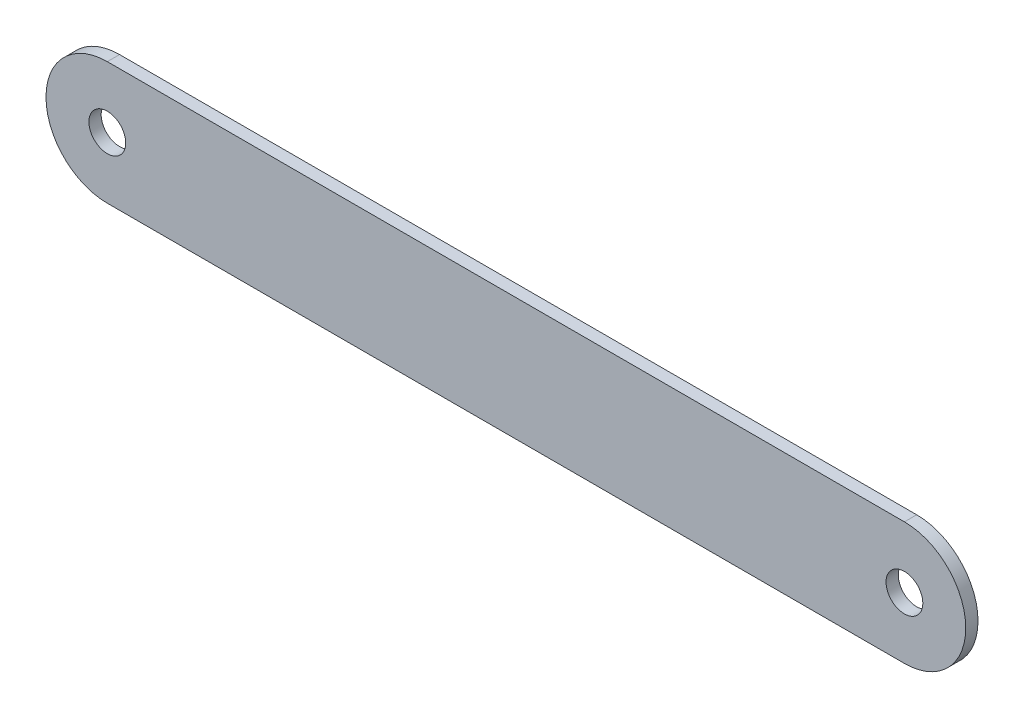
ISO-10303-21;
HEADER;
FILE_DESCRIPTION(('STEP AP214'),'2;1');
FILE_NAME('part.step','',(''),(''),'','','');
FILE_SCHEMA(('AUTOMOTIVE_DESIGN { 1 0 10303 214 1 1 1 1 }'));
ENDSEC;
DATA;
#1=APPLICATION_CONTEXT('core data for automotive mechanical design processes');
#2=APPLICATION_PROTOCOL_DEFINITION('international standard','automotive_design',2000,#1);
#3=PRODUCT_CONTEXT('',#1,'mechanical');
#4=PRODUCT('Part','Part','',(#3));
#5=PRODUCT_RELATED_PRODUCT_CATEGORY('part','',(#4));
#6=PRODUCT_DEFINITION_FORMATION('','',#4);
#7=PRODUCT_DEFINITION_CONTEXT('part definition',#1,'design');
#8=PRODUCT_DEFINITION('design','',#6,#7);
#9=PRODUCT_DEFINITION_SHAPE('','',#8);
#10=(LENGTH_UNIT() NAMED_UNIT(*) SI_UNIT(.MILLI.,.METRE.));
#11=(NAMED_UNIT(*) PLANE_ANGLE_UNIT() SI_UNIT($,.RADIAN.));
#12=(NAMED_UNIT(*) SI_UNIT($,.STERADIAN.) SOLID_ANGLE_UNIT());
#13=UNCERTAINTY_MEASURE_WITH_UNIT(LENGTH_MEASURE(1.E-05),#10,'distance_accuracy_value','');
#14=(GEOMETRIC_REPRESENTATION_CONTEXT(3) GLOBAL_UNCERTAINTY_ASSIGNED_CONTEXT((#13)) GLOBAL_UNIT_ASSIGNED_CONTEXT((#10,
#11,#12)) REPRESENTATION_CONTEXT('',''));
#15=CARTESIAN_POINT('',(0.,0.,0.));
#16=DIRECTION('',(0.,0.,1.));
#17=DIRECTION('',(1.,0.,0.));
#18=AXIS2_PLACEMENT_3D('',#15,#16,#17);
#19=CARTESIAN_POINT('',(-65.,0.,2.));
#20=DIRECTION('',(0.,0.,1.));
#21=DIRECTION('',(1.,0.,0.));
#22=AXIS2_PLACEMENT_3D('',#19,#20,#21);
#23=PLANE('',#22);
#24=CARTESIAN_POINT('',(-65.,0.,2.));
#25=DIRECTION('',(0.,0.,1.));
#26=DIRECTION('',(1.,0.,0.));
#27=AXIS2_PLACEMENT_3D('',#24,#25,#26);
#28=CIRCLE('',#27,3.00000000000001);
#29=CARTESIAN_POINT('',(-62.,0.,2.));
#30=VERTEX_POINT('',#29);
#31=EDGE_CURVE('E102',#30,#30,#28,.T.);
#32=ORIENTED_EDGE('',*,*,#31,.F.);
#33=EDGE_LOOP('',(#32));
#34=FACE_BOUND('',#33,.T.);
#35=CARTESIAN_POINT('',(-65.,0.,2.));
#36=DIRECTION('',(0.,0.,1.));
#37=DIRECTION('',(1.,0.,0.));
#38=AXIS2_PLACEMENT_3D('',#35,#36,#37);
#39=CIRCLE('',#38,9.99999967908888);
#40=CARTESIAN_POINT('',(-65.,9.99999967908888,2.));
#41=VERTEX_POINT('',#40);
#42=CARTESIAN_POINT('',(-65.,-9.99999967908888,2.));
#43=VERTEX_POINT('',#42);
#44=EDGE_CURVE('E87',#41,#43,#39,.T.);
#45=ORIENTED_EDGE('',*,*,#44,.T.);
#46=DIRECTION('',(1.,0.,0.));
#47=VECTOR('',#46,1.);
#48=CARTESIAN_POINT('',(-65.,-9.99999967908888,2.));
#49=LINE('',#48,#47);
#50=CARTESIAN_POINT('',(65.,-9.99999967908888,2.));
#51=VERTEX_POINT('',#50);
#52=EDGE_CURVE('E82',#43,#51,#49,.T.);
#53=ORIENTED_EDGE('',*,*,#52,.T.);
#54=CARTESIAN_POINT('',(65.,0.,2.));
#55=DIRECTION('',(0.,0.,1.));
#56=DIRECTION('',(1.,0.,0.));
#57=AXIS2_PLACEMENT_3D('',#54,#55,#56);
#58=CIRCLE('',#57,9.99999967908888);
#59=CARTESIAN_POINT('',(65.,9.99999967908888,2.));
#60=VERTEX_POINT('',#59);
#61=EDGE_CURVE('E85',#51,#60,#58,.T.);
#62=ORIENTED_EDGE('',*,*,#61,.T.);
#63=DIRECTION('',(-1.,0.,0.));
#64=VECTOR('',#63,1.);
#65=CARTESIAN_POINT('',(-65.,9.99999967908888,2.));
#66=LINE('',#65,#64);
#67=EDGE_CURVE('E52',#60,#41,#66,.T.);
#68=ORIENTED_EDGE('',*,*,#67,.T.);
#69=EDGE_LOOP('',(#45,#53,#62,#68));
#70=FACE_BOUND('',#69,.T.);
#71=CARTESIAN_POINT('',(65.,0.,2.));
#72=DIRECTION('',(0.,0.,1.));
#73=DIRECTION('',(1.,0.,0.));
#74=AXIS2_PLACEMENT_3D('',#71,#72,#73);
#75=CIRCLE('',#74,3.00000000001507);
#76=CARTESIAN_POINT('',(68.0000000000151,0.,2.));
#77=VERTEX_POINT('',#76);
#78=EDGE_CURVE('E117',#77,#77,#75,.T.);
#79=ORIENTED_EDGE('',*,*,#78,.F.);
#80=EDGE_LOOP('',(#79));
#81=FACE_BOUND('',#80,.T.);
#82=ADVANCED_FACE('F35',(#34,#70,#81),#23,.T.);
#83=CARTESIAN_POINT('',(-65.,0.,0.));
#84=DIRECTION('',(0.,0.,1.));
#85=DIRECTION('',(1.,0.,0.));
#86=AXIS2_PLACEMENT_3D('',#83,#84,#85);
#87=PLANE('',#86);
#88=CARTESIAN_POINT('',(-65.,0.,0.));
#89=DIRECTION('',(0.,0.,1.));
#90=DIRECTION('',(1.,0.,0.));
#91=AXIS2_PLACEMENT_3D('',#88,#89,#90);
#92=CIRCLE('',#91,9.99999967908888);
#93=CARTESIAN_POINT('',(-65.,9.99999967908888,0.));
#94=VERTEX_POINT('',#93);
#95=CARTESIAN_POINT('',(-65.,-9.99999967908888,0.));
#96=VERTEX_POINT('',#95);
#97=EDGE_CURVE('E99',#94,#96,#92,.T.);
#98=ORIENTED_EDGE('',*,*,#97,.F.);
#99=DIRECTION('',(-1.,0.,0.));
#100=VECTOR('',#99,1.);
#101=CARTESIAN_POINT('',(-65.,9.99999967908888,0.));
#102=LINE('',#101,#100);
#103=CARTESIAN_POINT('',(65.,9.99999967908888,0.));
#104=VERTEX_POINT('',#103);
#105=EDGE_CURVE('E75',#104,#94,#102,.T.);
#106=ORIENTED_EDGE('',*,*,#105,.F.);
#107=CARTESIAN_POINT('',(65.,0.,0.));
#108=DIRECTION('',(0.,0.,1.));
#109=DIRECTION('',(1.,0.,0.));
#110=AXIS2_PLACEMENT_3D('',#107,#108,#109);
#111=CIRCLE('',#110,9.99999967908888);
#112=CARTESIAN_POINT('',(65.,-9.99999967908888,0.));
#113=VERTEX_POINT('',#112);
#114=EDGE_CURVE('E69',#113,#104,#111,.T.);
#115=ORIENTED_EDGE('',*,*,#114,.F.);
#116=DIRECTION('',(1.,0.,0.));
#117=VECTOR('',#116,1.);
#118=CARTESIAN_POINT('',(-65.,-9.99999967908888,0.));
#119=LINE('',#118,#117);
#120=EDGE_CURVE('E91',#96,#113,#119,.T.);
#121=ORIENTED_EDGE('',*,*,#120,.F.);
#122=EDGE_LOOP('',(#98,#106,#115,#121));
#123=FACE_BOUND('',#122,.T.);
#124=CARTESIAN_POINT('',(-65.,0.,0.));
#125=DIRECTION('',(0.,0.,1.));
#126=DIRECTION('',(1.,0.,0.));
#127=AXIS2_PLACEMENT_3D('',#124,#125,#126);
#128=CIRCLE('',#127,3.00000000000001);
#129=CARTESIAN_POINT('',(-62.,0.,0.));
#130=VERTEX_POINT('',#129);
#131=EDGE_CURVE('E114',#130,#130,#128,.T.);
#132=ORIENTED_EDGE('',*,*,#131,.T.);
#133=EDGE_LOOP('',(#132));
#134=FACE_BOUND('',#133,.T.);
#135=CARTESIAN_POINT('',(65.,0.,0.));
#136=DIRECTION('',(0.,0.,1.));
#137=DIRECTION('',(1.,0.,0.));
#138=AXIS2_PLACEMENT_3D('',#135,#136,#137);
#139=CIRCLE('',#138,3.00000000001507);
#140=CARTESIAN_POINT('',(68.0000000000151,0.,0.));
#141=VERTEX_POINT('',#140);
#142=EDGE_CURVE('E120',#141,#141,#139,.T.);
#143=ORIENTED_EDGE('',*,*,#142,.T.);
#144=EDGE_LOOP('',(#143));
#145=FACE_BOUND('',#144,.T.);
#146=ADVANCED_FACE('F110',(#123,#134,#145),#87,.F.);
#147=CARTESIAN_POINT('',(-65.,0.,2.));
#148=DIRECTION('',(0.,0.,-1.));
#149=DIRECTION('',(-1.,0.,0.));
#150=AXIS2_PLACEMENT_3D('',#147,#148,#149);
#151=CYLINDRICAL_SURFACE('',#150,9.99999967908888);
#152=ORIENTED_EDGE('',*,*,#97,.T.);
#153=DIRECTION('',(0.,0.,-1.));
#154=VECTOR('',#153,1.);
#155=CARTESIAN_POINT('',(-65.,-9.99999967908888,2.));
#156=LINE('',#155,#154);
#157=EDGE_CURVE('E11',#43,#96,#156,.T.);
#158=ORIENTED_EDGE('',*,*,#157,.F.);
#159=ORIENTED_EDGE('',*,*,#44,.F.);
#160=DIRECTION('',(0.,0.,-1.));
#161=VECTOR('',#160,1.);
#162=CARTESIAN_POINT('',(-65.,9.99999967908888,2.));
#163=LINE('',#162,#161);
#164=EDGE_CURVE('E95',#41,#94,#163,.T.);
#165=ORIENTED_EDGE('',*,*,#164,.T.);
#166=EDGE_LOOP('',(#152,#158,#159,#165));
#167=FACE_BOUND('',#166,.T.);
#168=ADVANCED_FACE('F37',(#167),#151,.T.);
#169=CARTESIAN_POINT('',(-65.,-9.99999967908888,2.));
#170=DIRECTION('',(0.,1.,0.));
#171=DIRECTION('',(0.,0.,1.));
#172=AXIS2_PLACEMENT_3D('',#169,#170,#171);
#173=PLANE('',#172);
#174=ORIENTED_EDGE('',*,*,#120,.T.);
#175=DIRECTION('',(0.,0.,-1.));
#176=VECTOR('',#175,1.);
#177=CARTESIAN_POINT('',(65.,-9.99999967908888,2.));
#178=LINE('',#177,#176);
#179=EDGE_CURVE('E44',#51,#113,#178,.T.);
#180=ORIENTED_EDGE('',*,*,#179,.F.);
#181=ORIENTED_EDGE('',*,*,#52,.F.);
#182=ORIENTED_EDGE('',*,*,#157,.T.);
#183=EDGE_LOOP('',(#174,#180,#181,#182));
#184=FACE_BOUND('',#183,.T.);
#185=ADVANCED_FACE('F90',(#184),#173,.F.);
#186=CARTESIAN_POINT('',(65.,0.,2.));
#187=DIRECTION('',(0.,0.,-1.));
#188=DIRECTION('',(-1.,0.,0.));
#189=AXIS2_PLACEMENT_3D('',#186,#187,#188);
#190=CYLINDRICAL_SURFACE('',#189,9.99999967908888);
#191=ORIENTED_EDGE('',*,*,#114,.T.);
#192=DIRECTION('',(0.,0.,-1.));
#193=VECTOR('',#192,1.);
#194=CARTESIAN_POINT('',(65.,9.99999967908888,2.));
#195=LINE('',#194,#193);
#196=EDGE_CURVE('E92',#60,#104,#195,.T.);
#197=ORIENTED_EDGE('',*,*,#196,.F.);
#198=ORIENTED_EDGE('',*,*,#61,.F.);
#199=ORIENTED_EDGE('',*,*,#179,.T.);
#200=EDGE_LOOP('',(#191,#197,#198,#199));
#201=FACE_BOUND('',#200,.T.);
#202=ADVANCED_FACE('F93',(#201),#190,.T.);
#203=CARTESIAN_POINT('',(-65.,9.99999967908888,2.));
#204=DIRECTION('',(0.,-1.,0.));
#205=DIRECTION('',(0.,0.,-1.));
#206=AXIS2_PLACEMENT_3D('',#203,#204,#205);
#207=PLANE('',#206);
#208=ORIENTED_EDGE('',*,*,#105,.T.);
#209=ORIENTED_EDGE('',*,*,#164,.F.);
#210=ORIENTED_EDGE('',*,*,#67,.F.);
#211=ORIENTED_EDGE('',*,*,#196,.T.);
#212=EDGE_LOOP('',(#208,#209,#210,#211));
#213=FACE_BOUND('',#212,.T.);
#214=ADVANCED_FACE('F107',(#213),#207,.F.);
#215=CARTESIAN_POINT('',(-65.,0.,2.));
#216=DIRECTION('',(0.,0.,-1.));
#217=DIRECTION('',(-1.,0.,0.));
#218=AXIS2_PLACEMENT_3D('',#215,#216,#217);
#219=CYLINDRICAL_SURFACE('',#218,3.00000000000001);
#220=ORIENTED_EDGE('',*,*,#31,.T.);
#221=EDGE_LOOP('',(#220));
#222=FACE_BOUND('',#221,.T.);
#223=ORIENTED_EDGE('',*,*,#131,.F.);
#224=EDGE_LOOP('',(#223));
#225=FACE_BOUND('',#224,.T.);
#226=ADVANCED_FACE('F137',(#222,#225),#219,.F.);
#227=CARTESIAN_POINT('',(65.,0.,2.));
#228=DIRECTION('',(0.,0.,-1.));
#229=DIRECTION('',(-1.,0.,0.));
#230=AXIS2_PLACEMENT_3D('',#227,#228,#229);
#231=CYLINDRICAL_SURFACE('',#230,3.00000000001507);
#232=ORIENTED_EDGE('',*,*,#78,.T.);
#233=EDGE_LOOP('',(#232));
#234=FACE_BOUND('',#233,.T.);
#235=ORIENTED_EDGE('',*,*,#142,.F.);
#236=EDGE_LOOP('',(#235));
#237=FACE_BOUND('',#236,.T.);
#238=ADVANCED_FACE('F126',(#234,#237),#231,.F.);
#239=CLOSED_SHELL('',(#82,#146,#168,#185,#202,#214,#226,#238));
#240=MANIFOLD_SOLID_BREP('B2',#239);
#241=ADVANCED_BREP_SHAPE_REPRESENTATION('',(#18,#240),#14);
#242=SHAPE_DEFINITION_REPRESENTATION(#9,#241);
ENDSEC;
END-ISO-10303-21;
